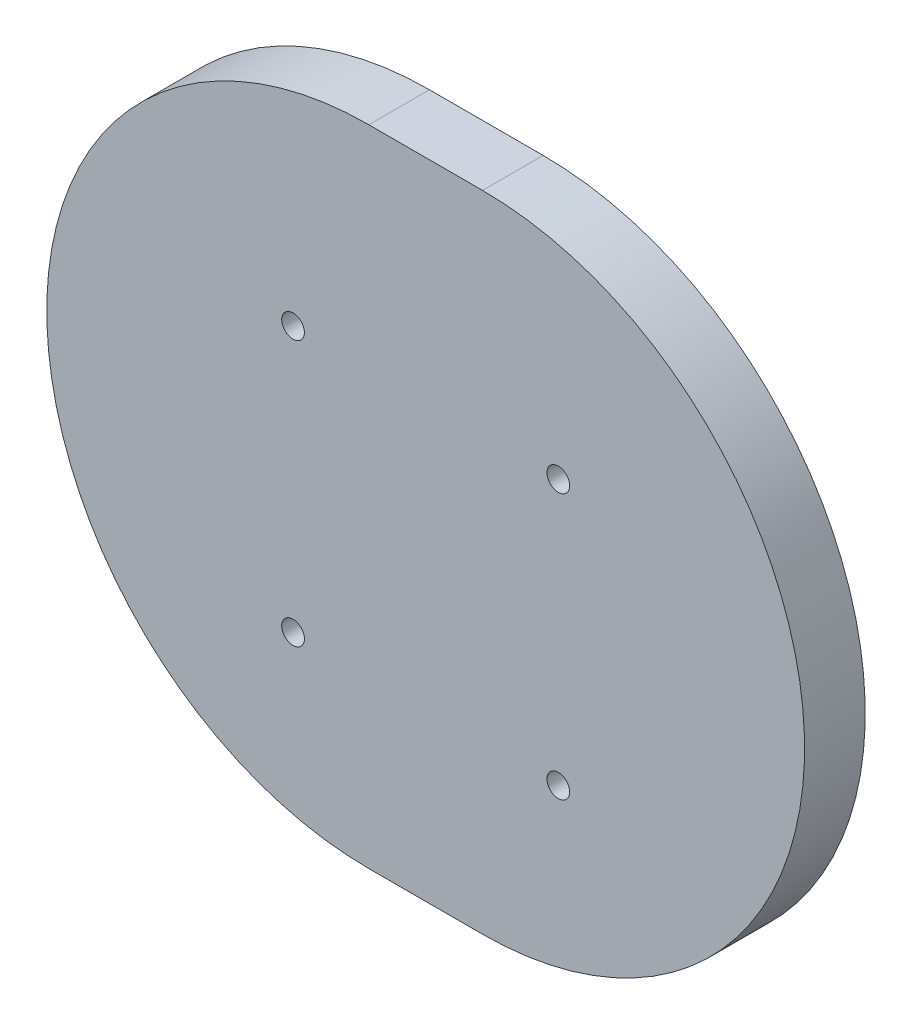
ISO-10303-21;
HEADER;
FILE_DESCRIPTION(('STEP AP214'),'2;1');
FILE_NAME('part.step','',(''),(''),'','','');
FILE_SCHEMA(('AUTOMOTIVE_DESIGN { 1 0 10303 214 1 1 1 1 }'));
ENDSEC;
DATA;
#1=APPLICATION_CONTEXT('core data for automotive mechanical design processes');
#2=APPLICATION_PROTOCOL_DEFINITION('international standard','automotive_design',2000,#1);
#3=PRODUCT_CONTEXT('',#1,'mechanical');
#4=PRODUCT('Part','Part','',(#3));
#5=PRODUCT_RELATED_PRODUCT_CATEGORY('part','',(#4));
#6=PRODUCT_DEFINITION_FORMATION('','',#4);
#7=PRODUCT_DEFINITION_CONTEXT('part definition',#1,'design');
#8=PRODUCT_DEFINITION('design','',#6,#7);
#9=PRODUCT_DEFINITION_SHAPE('','',#8);
#10=(LENGTH_UNIT() NAMED_UNIT(*) SI_UNIT(.MILLI.,.METRE.));
#11=(NAMED_UNIT(*) PLANE_ANGLE_UNIT() SI_UNIT($,.RADIAN.));
#12=(NAMED_UNIT(*) SI_UNIT($,.STERADIAN.) SOLID_ANGLE_UNIT());
#13=UNCERTAINTY_MEASURE_WITH_UNIT(LENGTH_MEASURE(1.E-05),#10,'distance_accuracy_value','');
#14=(GEOMETRIC_REPRESENTATION_CONTEXT(3) GLOBAL_UNCERTAINTY_ASSIGNED_CONTEXT((#13)) GLOBAL_UNIT_ASSIGNED_CONTEXT((#10,
#11,#12)) REPRESENTATION_CONTEXT('',''));
#15=CARTESIAN_POINT('',(0.,0.,0.));
#16=DIRECTION('',(0.,0.,1.));
#17=DIRECTION('',(1.,0.,0.));
#18=AXIS2_PLACEMENT_3D('',#15,#16,#17);
#19=CARTESIAN_POINT('',(-1.5,0.,1.6));
#20=DIRECTION('',(0.,0.,1.));
#21=DIRECTION('',(1.,0.,0.));
#22=AXIS2_PLACEMENT_3D('',#19,#20,#21);
#23=PLANE('',#22);
#24=CARTESIAN_POINT('',(-3.5,-4.1,1.6));
#25=DIRECTION('',(0.,0.,1.));
#26=DIRECTION('',(1.,0.,0.));
#27=AXIS2_PLACEMENT_3D('',#24,#25,#26);
#28=CIRCLE('',#27,0.3);
#29=CARTESIAN_POINT('',(-3.2,-4.1,1.6));
#30=VERTEX_POINT('',#29);
#31=EDGE_CURVE('E133',#30,#30,#28,.T.);
#32=ORIENTED_EDGE('',*,*,#31,.F.);
#33=EDGE_LOOP('',(#32));
#34=FACE_BOUND('',#33,.T.);
#35=CARTESIAN_POINT('',(3.5,2.9,1.6));
#36=DIRECTION('',(0.,0.,1.));
#37=DIRECTION('',(1.,0.,0.));
#38=AXIS2_PLACEMENT_3D('',#35,#36,#37);
#39=CIRCLE('',#38,0.3);
#40=CARTESIAN_POINT('',(3.8,2.9,1.6));
#41=VERTEX_POINT('',#40);
#42=EDGE_CURVE('E101',#41,#41,#39,.T.);
#43=ORIENTED_EDGE('',*,*,#42,.F.);
#44=EDGE_LOOP('',(#43));
#45=FACE_BOUND('',#44,.T.);
#46=CARTESIAN_POINT('',(-1.5,0.,1.6));
#47=DIRECTION('',(0.,0.,1.));
#48=DIRECTION('',(1.,0.,0.));
#49=AXIS2_PLACEMENT_3D('',#46,#47,#48);
#50=CIRCLE('',#49,8.5);
#51=CARTESIAN_POINT('',(-1.5,8.5,1.6));
#52=VERTEX_POINT('',#51);
#53=CARTESIAN_POINT('',(-1.5,-8.5,1.6));
#54=VERTEX_POINT('',#53);
#55=EDGE_CURVE('E85',#52,#54,#50,.T.);
#56=ORIENTED_EDGE('',*,*,#55,.T.);
#57=DIRECTION('',(1.,0.,0.));
#58=VECTOR('',#57,1.);
#59=CARTESIAN_POINT('',(-1.5,-8.5,1.6));
#60=LINE('',#59,#58);
#61=CARTESIAN_POINT('',(1.5,-8.5,1.6));
#62=VERTEX_POINT('',#61);
#63=EDGE_CURVE('E80',#54,#62,#60,.T.);
#64=ORIENTED_EDGE('',*,*,#63,.T.);
#65=CARTESIAN_POINT('',(1.5,0.,1.6));
#66=DIRECTION('',(0.,0.,1.));
#67=DIRECTION('',(1.,0.,0.));
#68=AXIS2_PLACEMENT_3D('',#65,#66,#67);
#69=CIRCLE('',#68,8.5);
#70=CARTESIAN_POINT('',(1.5,8.5,1.6));
#71=VERTEX_POINT('',#70);
#72=EDGE_CURVE('E83',#62,#71,#69,.T.);
#73=ORIENTED_EDGE('',*,*,#72,.T.);
#74=DIRECTION('',(-1.,0.,0.));
#75=VECTOR('',#74,1.);
#76=CARTESIAN_POINT('',(-1.5,8.5,1.6));
#77=LINE('',#76,#75);
#78=EDGE_CURVE('E50',#71,#52,#77,.T.);
#79=ORIENTED_EDGE('',*,*,#78,.T.);
#80=EDGE_LOOP('',(#56,#64,#73,#79));
#81=FACE_BOUND('',#80,.T.);
#82=CARTESIAN_POINT('',(-3.5,2.9,1.6));
#83=DIRECTION('',(0.,0.,1.));
#84=DIRECTION('',(1.,0.,0.));
#85=AXIS2_PLACEMENT_3D('',#82,#83,#84);
#86=CIRCLE('',#85,0.3);
#87=CARTESIAN_POINT('',(-3.2,2.9,1.6));
#88=VERTEX_POINT('',#87);
#89=EDGE_CURVE('E124',#88,#88,#86,.T.);
#90=ORIENTED_EDGE('',*,*,#89,.F.);
#91=EDGE_LOOP('',(#90));
#92=FACE_BOUND('',#91,.T.);
#93=CARTESIAN_POINT('',(3.5,-4.1,1.6));
#94=DIRECTION('',(0.,0.,1.));
#95=DIRECTION('',(1.,0.,0.));
#96=AXIS2_PLACEMENT_3D('',#93,#94,#95);
#97=CIRCLE('',#96,0.3);
#98=CARTESIAN_POINT('',(3.8,-4.1,1.6));
#99=VERTEX_POINT('',#98);
#100=EDGE_CURVE('E139',#99,#99,#97,.T.);
#101=ORIENTED_EDGE('',*,*,#100,.F.);
#102=EDGE_LOOP('',(#101));
#103=FACE_BOUND('',#102,.T.);
#104=ADVANCED_FACE('F33',(#34,#45,#81,#92,#103),#23,.T.);
#105=CARTESIAN_POINT('',(-1.5,0.,0.));
#106=DIRECTION('',(0.,0.,1.));
#107=DIRECTION('',(1.,0.,0.));
#108=AXIS2_PLACEMENT_3D('',#105,#106,#107);
#109=PLANE('',#108);
#110=CARTESIAN_POINT('',(-1.5,0.,0.));
#111=DIRECTION('',(0.,0.,1.));
#112=DIRECTION('',(1.,0.,0.));
#113=AXIS2_PLACEMENT_3D('',#110,#111,#112);
#114=CIRCLE('',#113,8.5);
#115=CARTESIAN_POINT('',(-1.5,8.5,0.));
#116=VERTEX_POINT('',#115);
#117=CARTESIAN_POINT('',(-1.5,-8.5,0.));
#118=VERTEX_POINT('',#117);
#119=EDGE_CURVE('E97',#116,#118,#114,.T.);
#120=ORIENTED_EDGE('',*,*,#119,.F.);
#121=DIRECTION('',(-1.,0.,0.));
#122=VECTOR('',#121,1.);
#123=CARTESIAN_POINT('',(-1.5,8.5,0.));
#124=LINE('',#123,#122);
#125=CARTESIAN_POINT('',(1.5,8.5,0.));
#126=VERTEX_POINT('',#125);
#127=EDGE_CURVE('E73',#126,#116,#124,.T.);
#128=ORIENTED_EDGE('',*,*,#127,.F.);
#129=CARTESIAN_POINT('',(1.5,0.,0.));
#130=DIRECTION('',(0.,0.,1.));
#131=DIRECTION('',(1.,0.,0.));
#132=AXIS2_PLACEMENT_3D('',#129,#130,#131);
#133=CIRCLE('',#132,8.5);
#134=CARTESIAN_POINT('',(1.5,-8.5,0.));
#135=VERTEX_POINT('',#134);
#136=EDGE_CURVE('E67',#135,#126,#133,.T.);
#137=ORIENTED_EDGE('',*,*,#136,.F.);
#138=DIRECTION('',(1.,0.,0.));
#139=VECTOR('',#138,1.);
#140=CARTESIAN_POINT('',(-1.5,-8.5,0.));
#141=LINE('',#140,#139);
#142=EDGE_CURVE('E89',#118,#135,#141,.T.);
#143=ORIENTED_EDGE('',*,*,#142,.F.);
#144=EDGE_LOOP('',(#120,#128,#137,#143));
#145=FACE_BOUND('',#144,.T.);
#146=CARTESIAN_POINT('',(3.5,2.9,0.));
#147=DIRECTION('',(0.,0.,1.));
#148=DIRECTION('',(1.,0.,0.));
#149=AXIS2_PLACEMENT_3D('',#146,#147,#148);
#150=CIRCLE('',#149,0.3);
#151=CARTESIAN_POINT('',(3.8,2.9,0.));
#152=VERTEX_POINT('',#151);
#153=EDGE_CURVE('E120',#152,#152,#150,.T.);
#154=ORIENTED_EDGE('',*,*,#153,.T.);
#155=EDGE_LOOP('',(#154));
#156=FACE_BOUND('',#155,.T.);
#157=CARTESIAN_POINT('',(-3.5,2.9,0.));
#158=DIRECTION('',(0.,0.,1.));
#159=DIRECTION('',(1.,0.,0.));
#160=AXIS2_PLACEMENT_3D('',#157,#158,#159);
#161=CIRCLE('',#160,0.3);
#162=CARTESIAN_POINT('',(-3.2,2.9,0.));
#163=VERTEX_POINT('',#162);
#164=EDGE_CURVE('E129',#163,#163,#161,.T.);
#165=ORIENTED_EDGE('',*,*,#164,.T.);
#166=EDGE_LOOP('',(#165));
#167=FACE_BOUND('',#166,.T.);
#168=CARTESIAN_POINT('',(-3.5,-4.1,0.));
#169=DIRECTION('',(0.,0.,1.));
#170=DIRECTION('',(1.,0.,0.));
#171=AXIS2_PLACEMENT_3D('',#168,#169,#170);
#172=CIRCLE('',#171,0.3);
#173=CARTESIAN_POINT('',(-3.2,-4.1,0.));
#174=VERTEX_POINT('',#173);
#175=EDGE_CURVE('E135',#174,#174,#172,.T.);
#176=ORIENTED_EDGE('',*,*,#175,.T.);
#177=EDGE_LOOP('',(#176));
#178=FACE_BOUND('',#177,.T.);
#179=CARTESIAN_POINT('',(3.5,-4.1,0.));
#180=DIRECTION('',(0.,0.,1.));
#181=DIRECTION('',(1.,0.,0.));
#182=AXIS2_PLACEMENT_3D('',#179,#180,#181);
#183=CIRCLE('',#182,0.3);
#184=CARTESIAN_POINT('',(3.8,-4.1,0.));
#185=VERTEX_POINT('',#184);
#186=EDGE_CURVE('E141',#185,#185,#183,.T.);
#187=ORIENTED_EDGE('',*,*,#186,.T.);
#188=EDGE_LOOP('',(#187));
#189=FACE_BOUND('',#188,.T.);
#190=ADVANCED_FACE('F116',(#145,#156,#167,#178,#189),#109,.F.);
#191=CARTESIAN_POINT('',(-1.5,0.,1.6));
#192=DIRECTION('',(0.,0.,-1.));
#193=DIRECTION('',(-1.,0.,0.));
#194=AXIS2_PLACEMENT_3D('',#191,#192,#193);
#195=CYLINDRICAL_SURFACE('',#194,8.5);
#196=ORIENTED_EDGE('',*,*,#119,.T.);
#197=DIRECTION('',(0.,0.,-1.));
#198=VECTOR('',#197,1.);
#199=CARTESIAN_POINT('',(-1.5,-8.5,1.6));
#200=LINE('',#199,#198);
#201=EDGE_CURVE('E12',#54,#118,#200,.T.);
#202=ORIENTED_EDGE('',*,*,#201,.F.);
#203=ORIENTED_EDGE('',*,*,#55,.F.);
#204=DIRECTION('',(0.,0.,-1.));
#205=VECTOR('',#204,1.);
#206=CARTESIAN_POINT('',(-1.5,8.5,1.6));
#207=LINE('',#206,#205);
#208=EDGE_CURVE('E93',#52,#116,#207,.T.);
#209=ORIENTED_EDGE('',*,*,#208,.T.);
#210=EDGE_LOOP('',(#196,#202,#203,#209));
#211=FACE_BOUND('',#210,.T.);
#212=ADVANCED_FACE('F35',(#211),#195,.T.);
#213=CARTESIAN_POINT('',(-1.5,-8.5,1.6));
#214=DIRECTION('',(0.,1.,0.));
#215=DIRECTION('',(0.,0.,1.));
#216=AXIS2_PLACEMENT_3D('',#213,#214,#215);
#217=PLANE('',#216);
#218=ORIENTED_EDGE('',*,*,#142,.T.);
#219=DIRECTION('',(0.,0.,-1.));
#220=VECTOR('',#219,1.);
#221=CARTESIAN_POINT('',(1.5,-8.5,1.6));
#222=LINE('',#221,#220);
#223=EDGE_CURVE('E42',#62,#135,#222,.T.);
#224=ORIENTED_EDGE('',*,*,#223,.F.);
#225=ORIENTED_EDGE('',*,*,#63,.F.);
#226=ORIENTED_EDGE('',*,*,#201,.T.);
#227=EDGE_LOOP('',(#218,#224,#225,#226));
#228=FACE_BOUND('',#227,.T.);
#229=ADVANCED_FACE('F88',(#228),#217,.F.);
#230=CARTESIAN_POINT('',(1.5,0.,1.6));
#231=DIRECTION('',(0.,0.,-1.));
#232=DIRECTION('',(-1.,0.,0.));
#233=AXIS2_PLACEMENT_3D('',#230,#231,#232);
#234=CYLINDRICAL_SURFACE('',#233,8.5);
#235=ORIENTED_EDGE('',*,*,#136,.T.);
#236=DIRECTION('',(0.,0.,-1.));
#237=VECTOR('',#236,1.);
#238=CARTESIAN_POINT('',(1.5,8.5,1.6));
#239=LINE('',#238,#237);
#240=EDGE_CURVE('E90',#71,#126,#239,.T.);
#241=ORIENTED_EDGE('',*,*,#240,.F.);
#242=ORIENTED_EDGE('',*,*,#72,.F.);
#243=ORIENTED_EDGE('',*,*,#223,.T.);
#244=EDGE_LOOP('',(#235,#241,#242,#243));
#245=FACE_BOUND('',#244,.T.);
#246=ADVANCED_FACE('F91',(#245),#234,.T.);
#247=CARTESIAN_POINT('',(-1.5,8.5,1.6));
#248=DIRECTION('',(0.,-1.,0.));
#249=DIRECTION('',(0.,0.,-1.));
#250=AXIS2_PLACEMENT_3D('',#247,#248,#249);
#251=PLANE('',#250);
#252=ORIENTED_EDGE('',*,*,#127,.T.);
#253=ORIENTED_EDGE('',*,*,#208,.F.);
#254=ORIENTED_EDGE('',*,*,#78,.F.);
#255=ORIENTED_EDGE('',*,*,#240,.T.);
#256=EDGE_LOOP('',(#252,#253,#254,#255));
#257=FACE_BOUND('',#256,.T.);
#258=ADVANCED_FACE('F113',(#257),#251,.F.);
#259=CARTESIAN_POINT('',(3.5,2.9,1.6));
#260=DIRECTION('',(0.,0.,-1.));
#261=DIRECTION('',(-1.,0.,0.));
#262=AXIS2_PLACEMENT_3D('',#259,#260,#261);
#263=CYLINDRICAL_SURFACE('',#262,0.3);
#264=ORIENTED_EDGE('',*,*,#42,.T.);
#265=EDGE_LOOP('',(#264));
#266=FACE_BOUND('',#265,.T.);
#267=ORIENTED_EDGE('',*,*,#153,.F.);
#268=EDGE_LOOP('',(#267));
#269=FACE_BOUND('',#268,.T.);
#270=ADVANCED_FACE('F161',(#266,#269),#263,.F.);
#271=CARTESIAN_POINT('',(-3.5,2.9,1.6));
#272=DIRECTION('',(0.,0.,-1.));
#273=DIRECTION('',(-1.,0.,0.));
#274=AXIS2_PLACEMENT_3D('',#271,#272,#273);
#275=CYLINDRICAL_SURFACE('',#274,0.3);
#276=ORIENTED_EDGE('',*,*,#89,.T.);
#277=EDGE_LOOP('',(#276));
#278=FACE_BOUND('',#277,.T.);
#279=ORIENTED_EDGE('',*,*,#164,.F.);
#280=EDGE_LOOP('',(#279));
#281=FACE_BOUND('',#280,.T.);
#282=ADVANCED_FACE('F207',(#278,#281),#275,.F.);
#283=CARTESIAN_POINT('',(-3.5,-4.1,1.6));
#284=DIRECTION('',(0.,0.,-1.));
#285=DIRECTION('',(-1.,0.,0.));
#286=AXIS2_PLACEMENT_3D('',#283,#284,#285);
#287=CYLINDRICAL_SURFACE('',#286,0.3);
#288=ORIENTED_EDGE('',*,*,#31,.T.);
#289=EDGE_LOOP('',(#288));
#290=FACE_BOUND('',#289,.T.);
#291=ORIENTED_EDGE('',*,*,#175,.F.);
#292=EDGE_LOOP('',(#291));
#293=FACE_BOUND('',#292,.T.);
#294=ADVANCED_FACE('F215',(#290,#293),#287,.F.);
#295=CARTESIAN_POINT('',(3.5,-4.1,1.6));
#296=DIRECTION('',(0.,0.,-1.));
#297=DIRECTION('',(-1.,0.,0.));
#298=AXIS2_PLACEMENT_3D('',#295,#296,#297);
#299=CYLINDRICAL_SURFACE('',#298,0.3);
#300=ORIENTED_EDGE('',*,*,#100,.T.);
#301=EDGE_LOOP('',(#300));
#302=FACE_BOUND('',#301,.T.);
#303=ORIENTED_EDGE('',*,*,#186,.F.);
#304=EDGE_LOOP('',(#303));
#305=FACE_BOUND('',#304,.T.);
#306=ADVANCED_FACE('F148',(#302,#305),#299,.F.);
#307=CLOSED_SHELL('',(#104,#190,#212,#229,#246,#258,#270,#282,#294,#306));
#308=MANIFOLD_SOLID_BREP('B2',#307);
#309=ADVANCED_BREP_SHAPE_REPRESENTATION('',(#18,#308),#14);
#310=SHAPE_DEFINITION_REPRESENTATION(#9,#309);
ENDSEC;
END-ISO-10303-21;
